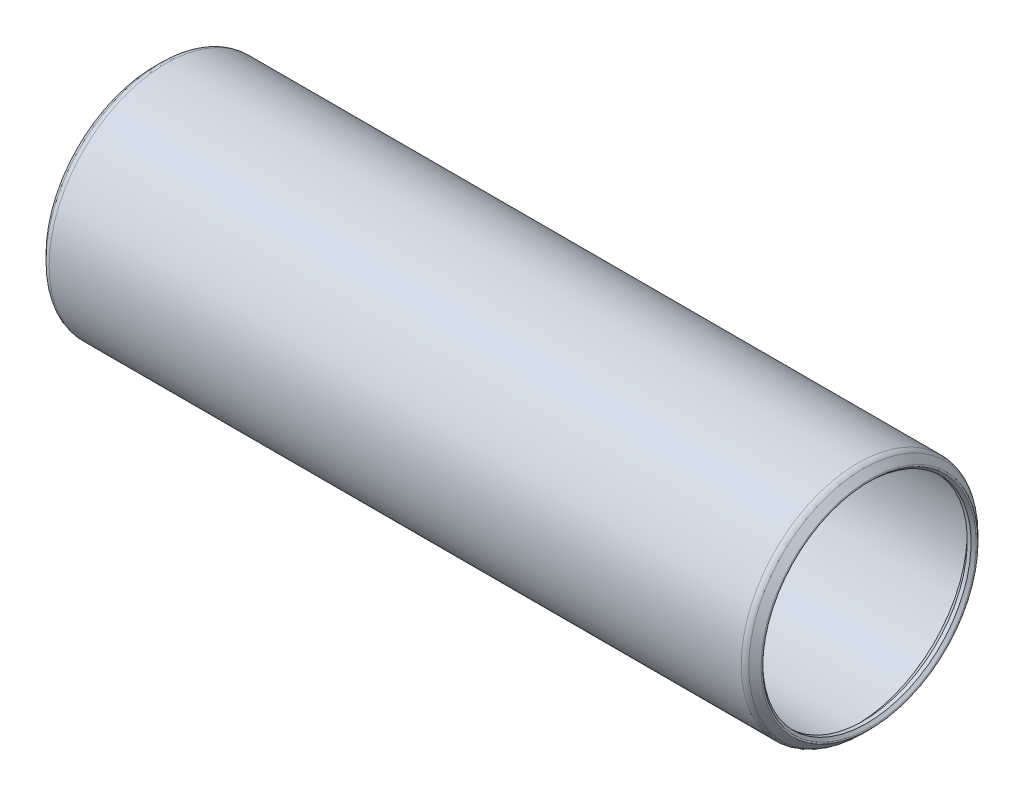
ISO-10303-21;
HEADER;
FILE_DESCRIPTION(('STEP AP214'),'2;1');
FILE_NAME('part.step','',(''),(''),'','','');
FILE_SCHEMA(('AUTOMOTIVE_DESIGN { 1 0 10303 214 1 1 1 1 }'));
ENDSEC;
DATA;
#1=APPLICATION_CONTEXT('core data for automotive mechanical design processes');
#2=APPLICATION_PROTOCOL_DEFINITION('international standard','automotive_design',2000,#1);
#3=PRODUCT_CONTEXT('',#1,'mechanical');
#4=PRODUCT('Part','Part','',(#3));
#5=PRODUCT_RELATED_PRODUCT_CATEGORY('part','',(#4));
#6=PRODUCT_DEFINITION_FORMATION('','',#4);
#7=PRODUCT_DEFINITION_CONTEXT('part definition',#1,'design');
#8=PRODUCT_DEFINITION('design','',#6,#7);
#9=PRODUCT_DEFINITION_SHAPE('','',#8);
#10=(LENGTH_UNIT() NAMED_UNIT(*) SI_UNIT(.MILLI.,.METRE.));
#11=(NAMED_UNIT(*) PLANE_ANGLE_UNIT() SI_UNIT($,.RADIAN.));
#12=(NAMED_UNIT(*) SI_UNIT($,.STERADIAN.) SOLID_ANGLE_UNIT());
#13=UNCERTAINTY_MEASURE_WITH_UNIT(LENGTH_MEASURE(1.E-05),#10,'distance_accuracy_value','');
#14=(GEOMETRIC_REPRESENTATION_CONTEXT(3) GLOBAL_UNCERTAINTY_ASSIGNED_CONTEXT((#13)) GLOBAL_UNIT_ASSIGNED_CONTEXT((#10,
#11,#12)) REPRESENTATION_CONTEXT('',''));
#15=CARTESIAN_POINT('',(0.,0.,0.));
#16=DIRECTION('',(0.,0.,1.));
#17=DIRECTION('',(1.,0.,0.));
#18=AXIS2_PLACEMENT_3D('',#15,#16,#17);
#19=CARTESIAN_POINT('',(-0.549710244842029,0.,0.));
#20=DIRECTION('',(-1.,0.,0.));
#21=DIRECTION('',(0.,0.,1.));
#22=AXIS2_PLACEMENT_3D('',#19,#20,#21);
#23=TOROIDAL_SURFACE('',#22,10.832165367264,0.127000000000741);
#24=CARTESIAN_POINT('',(-0.639512806053455,0.,0.));
#25=DIRECTION('',(-1.,0.,0.));
#26=DIRECTION('',(0.,0.,1.));
#27=AXIS2_PLACEMENT_3D('',#24,#25,#26);
#28=CIRCLE('',#27,10.742362806053);
#29=CARTESIAN_POINT('',(-0.639512806053455,0.,10.742362806053));
#30=VERTEX_POINT('',#29);
#31=EDGE_CURVE('E10',#30,#30,#28,.T.);
#32=ORIENTED_EDGE('',*,*,#31,.F.);
#33=EDGE_LOOP('',(#32));
#34=FACE_BOUND('',#33,.T.);
#35=CARTESIAN_POINT('',(-0.639512806053455,0.,0.));
#36=DIRECTION('',(-1.,0.,0.));
#37=DIRECTION('',(0.,0.,1.));
#38=AXIS2_PLACEMENT_3D('',#35,#36,#37);
#39=CIRCLE('',#38,10.921967928475);
#40=CARTESIAN_POINT('',(-0.639512806053455,0.,10.921967928475));
#41=VERTEX_POINT('',#40);
#42=EDGE_CURVE('E80',#41,#41,#39,.T.);
#43=ORIENTED_EDGE('',*,*,#42,.T.);
#44=EDGE_LOOP('',(#43));
#45=FACE_BOUND('',#44,.T.);
#46=ADVANCED_FACE('F34',(#34,#45),#23,.T.);
#47=CARTESIAN_POINT('',(-0.639512806053455,0.,0.));
#48=DIRECTION('',(-1.,0.,0.));
#49=DIRECTION('',(0.,0.,1.));
#50=AXIS2_PLACEMENT_3D('',#47,#48,#49);
#51=CONICAL_SURFACE('',#50,10.742362806053,0.785398163396579);
#52=CARTESIAN_POINT('',(-0.381000000000006,0.,0.));
#53=DIRECTION('',(-1.,0.,0.));
#54=DIRECTION('',(0.,0.,1.));
#55=AXIS2_PLACEMENT_3D('',#52,#53,#54);
#56=CIRCLE('',#55,10.48385);
#57=CARTESIAN_POINT('',(-0.381000000000006,0.,10.48385));
#58=VERTEX_POINT('',#57);
#59=EDGE_CURVE('E40',#58,#58,#56,.T.);
#60=ORIENTED_EDGE('',*,*,#59,.F.);
#61=EDGE_LOOP('',(#60));
#62=FACE_BOUND('',#61,.T.);
#63=ORIENTED_EDGE('',*,*,#31,.T.);
#64=EDGE_LOOP('',(#63));
#65=FACE_BOUND('',#64,.T.);
#66=ADVANCED_FACE('F153',(#62,#65),#51,.F.);
#67=CARTESIAN_POINT('',(70.7009,0.,0.));
#68=DIRECTION('',(-1.,0.,0.));
#69=DIRECTION('',(0.,0.,1.));
#70=AXIS2_PLACEMENT_3D('',#67,#68,#69);
#71=CYLINDRICAL_SURFACE('',#70,10.48385);
#72=CARTESIAN_POINT('',(0.,0.,0.));
#73=DIRECTION('',(-1.,0.,0.));
#74=DIRECTION('',(0.,0.,1.));
#75=AXIS2_PLACEMENT_3D('',#72,#73,#74);
#76=CIRCLE('',#75,10.48385);
#77=CARTESIAN_POINT('',(0.,0.,10.48385));
#78=VERTEX_POINT('',#77);
#79=EDGE_CURVE('E44',#78,#78,#76,.T.);
#80=ORIENTED_EDGE('',*,*,#79,.F.);
#81=EDGE_LOOP('',(#80));
#82=FACE_BOUND('',#81,.T.);
#83=ORIENTED_EDGE('',*,*,#59,.T.);
#84=EDGE_LOOP('',(#83));
#85=FACE_BOUND('',#84,.T.);
#86=ADVANCED_FACE('F148',(#82,#85),#71,.F.);
#87=CARTESIAN_POINT('',(0.,0.,0.));
#88=DIRECTION('',(1.,0.,0.));
#89=DIRECTION('',(0.,0.,-1.));
#90=AXIS2_PLACEMENT_3D('',#87,#88,#89);
#91=CONICAL_SURFACE('',#90,10.48385,0.78539816339745);
#92=CARTESIAN_POINT('',(0.761999999999999,0.,0.));
#93=DIRECTION('',(-1.,0.,0.));
#94=DIRECTION('',(0.,0.,1.));
#95=AXIS2_PLACEMENT_3D('',#92,#93,#94);
#96=CIRCLE('',#95,11.24585);
#97=CARTESIAN_POINT('',(0.761999999999999,0.,11.24585));
#98=VERTEX_POINT('',#97);
#99=EDGE_CURVE('E48',#98,#98,#96,.T.);
#100=ORIENTED_EDGE('',*,*,#99,.F.);
#101=EDGE_LOOP('',(#100));
#102=FACE_BOUND('',#101,.T.);
#103=ORIENTED_EDGE('',*,*,#79,.T.);
#104=EDGE_LOOP('',(#103));
#105=FACE_BOUND('',#104,.T.);
#106=ADVANCED_FACE('F142',(#102,#105),#91,.F.);
#107=CARTESIAN_POINT('',(70.7009,0.,0.));
#108=DIRECTION('',(-1.,0.,0.));
#109=DIRECTION('',(0.,0.,1.));
#110=AXIS2_PLACEMENT_3D('',#107,#108,#109);
#111=CYLINDRICAL_SURFACE('',#110,11.24585);
#112=CARTESIAN_POINT('',(69.9389,0.,0.));
#113=DIRECTION('',(-1.,0.,0.));
#114=DIRECTION('',(0.,0.,1.));
#115=AXIS2_PLACEMENT_3D('',#112,#113,#114);
#116=CIRCLE('',#115,11.24585);
#117=CARTESIAN_POINT('',(69.9389,0.,11.24585));
#118=VERTEX_POINT('',#117);
#119=EDGE_CURVE('E53',#118,#118,#116,.T.);
#120=ORIENTED_EDGE('',*,*,#119,.F.);
#121=EDGE_LOOP('',(#120));
#122=FACE_BOUND('',#121,.T.);
#123=ORIENTED_EDGE('',*,*,#99,.T.);
#124=EDGE_LOOP('',(#123));
#125=FACE_BOUND('',#124,.T.);
#126=ADVANCED_FACE('F136',(#122,#125),#111,.F.);
#127=CARTESIAN_POINT('',(69.9389,0.,0.));
#128=DIRECTION('',(-1.,0.,0.));
#129=DIRECTION('',(0.,0.,1.));
#130=AXIS2_PLACEMENT_3D('',#127,#128,#129);
#131=CONICAL_SURFACE('',#130,11.24585,0.78539816339745);
#132=CARTESIAN_POINT('',(70.7009,0.,0.));
#133=DIRECTION('',(-1.,0.,0.));
#134=DIRECTION('',(0.,0.,1.));
#135=AXIS2_PLACEMENT_3D('',#132,#133,#134);
#136=CIRCLE('',#135,10.48385);
#137=CARTESIAN_POINT('',(70.7009,0.,10.48385));
#138=VERTEX_POINT('',#137);
#139=EDGE_CURVE('E56',#138,#138,#136,.T.);
#140=ORIENTED_EDGE('',*,*,#139,.F.);
#141=EDGE_LOOP('',(#140));
#142=FACE_BOUND('',#141,.T.);
#143=ORIENTED_EDGE('',*,*,#119,.T.);
#144=EDGE_LOOP('',(#143));
#145=FACE_BOUND('',#144,.T.);
#146=ADVANCED_FACE('F130',(#142,#145),#131,.F.);
#147=CARTESIAN_POINT('',(70.7009,0.,0.));
#148=DIRECTION('',(-1.,0.,0.));
#149=DIRECTION('',(0.,0.,1.));
#150=AXIS2_PLACEMENT_3D('',#147,#148,#149);
#151=CYLINDRICAL_SURFACE('',#150,10.48385);
#152=CARTESIAN_POINT('',(71.0819,0.,0.));
#153=DIRECTION('',(-1.,0.,0.));
#154=DIRECTION('',(0.,0.,1.));
#155=AXIS2_PLACEMENT_3D('',#152,#153,#154);
#156=CIRCLE('',#155,10.48385);
#157=CARTESIAN_POINT('',(71.0819,0.,10.48385));
#158=VERTEX_POINT('',#157);
#159=EDGE_CURVE('E59',#158,#158,#156,.T.);
#160=ORIENTED_EDGE('',*,*,#159,.F.);
#161=EDGE_LOOP('',(#160));
#162=FACE_BOUND('',#161,.T.);
#163=ORIENTED_EDGE('',*,*,#139,.T.);
#164=EDGE_LOOP('',(#163));
#165=FACE_BOUND('',#164,.T.);
#166=ADVANCED_FACE('F124',(#162,#165),#151,.F.);
#167=CARTESIAN_POINT('',(71.0819,0.,0.));
#168=DIRECTION('',(1.,0.,0.));
#169=DIRECTION('',(0.,0.,-1.));
#170=AXIS2_PLACEMENT_3D('',#167,#168,#169);
#171=CONICAL_SURFACE('',#170,10.48385,0.785398163397257);
#172=CARTESIAN_POINT('',(71.3404128060541,0.,0.));
#173=DIRECTION('',(-1.,0.,0.));
#174=DIRECTION('',(0.,0.,1.));
#175=AXIS2_PLACEMENT_3D('',#172,#173,#174);
#176=CIRCLE('',#175,10.742362806054);
#177=CARTESIAN_POINT('',(71.3404128060541,0.,10.742362806054));
#178=VERTEX_POINT('',#177);
#179=EDGE_CURVE('E62',#178,#178,#176,.T.);
#180=ORIENTED_EDGE('',*,*,#179,.F.);
#181=EDGE_LOOP('',(#180));
#182=FACE_BOUND('',#181,.T.);
#183=ORIENTED_EDGE('',*,*,#159,.T.);
#184=EDGE_LOOP('',(#183));
#185=FACE_BOUND('',#184,.T.);
#186=ADVANCED_FACE('F118',(#182,#185),#171,.F.);
#187=CARTESIAN_POINT('',(71.2506102448439,0.,0.));
#188=DIRECTION('',(-1.,0.,0.));
#189=DIRECTION('',(0.,0.,1.));
#190=AXIS2_PLACEMENT_3D('',#187,#188,#189);
#191=TOROIDAL_SURFACE('',#190,10.832165367264,0.126999999999133);
#192=CARTESIAN_POINT('',(71.3404128060541,0.,0.));
#193=DIRECTION('',(-1.,0.,0.));
#194=DIRECTION('',(0.,0.,1.));
#195=AXIS2_PLACEMENT_3D('',#192,#193,#194);
#196=CIRCLE('',#195,10.9219679284741);
#197=CARTESIAN_POINT('',(71.3404128060541,0.,10.9219679284741));
#198=VERTEX_POINT('',#197);
#199=EDGE_CURVE('E65',#198,#198,#196,.T.);
#200=ORIENTED_EDGE('',*,*,#199,.F.);
#201=EDGE_LOOP('',(#200));
#202=FACE_BOUND('',#201,.T.);
#203=ORIENTED_EDGE('',*,*,#179,.T.);
#204=EDGE_LOOP('',(#203));
#205=FACE_BOUND('',#204,.T.);
#206=ADVANCED_FACE('F112',(#202,#205),#191,.T.);
#207=CARTESIAN_POINT('',(71.3404128060541,0.,0.));
#208=DIRECTION('',(-1.,0.,0.));
#209=DIRECTION('',(0.,0.,1.));
#210=AXIS2_PLACEMENT_3D('',#207,#208,#209);
#211=CONICAL_SURFACE('',#210,10.9219679284741,0.785398163397464);
#212=CARTESIAN_POINT('',(70.7253653672625,0.,0.));
#213=DIRECTION('',(-1.,0.,0.));
#214=DIRECTION('',(0.,0.,1.));
#215=AXIS2_PLACEMENT_3D('',#212,#213,#214);
#216=CIRCLE('',#215,11.5370153672658);
#217=CARTESIAN_POINT('',(70.7253653672625,0.,11.5370153672658));
#218=VERTEX_POINT('',#217);
#219=EDGE_CURVE('E68',#218,#218,#216,.T.);
#220=ORIENTED_EDGE('',*,*,#219,.F.);
#221=EDGE_LOOP('',(#220));
#222=FACE_BOUND('',#221,.T.);
#223=ORIENTED_EDGE('',*,*,#199,.T.);
#224=EDGE_LOOP('',(#223));
#225=FACE_BOUND('',#224,.T.);
#226=ADVANCED_FACE('F106',(#222,#225),#211,.T.);
#227=CARTESIAN_POINT('',(70.1865500000017,0.,0.));
#228=DIRECTION('',(-1.,0.,0.));
#229=DIRECTION('',(0.,0.,1.));
#230=AXIS2_PLACEMENT_3D('',#227,#228,#229);
#231=TOROIDAL_SURFACE('',#230,10.9982000000049,0.761999999995272);
#232=CARTESIAN_POINT('',(70.1865500000017,0.,0.));
#233=DIRECTION('',(-1.,0.,0.));
#234=DIRECTION('',(0.,0.,1.));
#235=AXIS2_PLACEMENT_3D('',#232,#233,#234);
#236=CIRCLE('',#235,11.7602000000002);
#237=CARTESIAN_POINT('',(70.1865500000017,0.,11.7602000000002));
#238=VERTEX_POINT('',#237);
#239=EDGE_CURVE('E71',#238,#238,#236,.T.);
#240=ORIENTED_EDGE('',*,*,#239,.F.);
#241=EDGE_LOOP('',(#240));
#242=FACE_BOUND('',#241,.T.);
#243=ORIENTED_EDGE('',*,*,#219,.T.);
#244=EDGE_LOOP('',(#243));
#245=FACE_BOUND('',#244,.T.);
#246=ADVANCED_FACE('F100',(#242,#245),#231,.T.);
#247=CARTESIAN_POINT('',(70.7009,0.,0.));
#248=DIRECTION('',(-1.,0.,0.));
#249=DIRECTION('',(0.,0.,1.));
#250=AXIS2_PLACEMENT_3D('',#247,#248,#249);
#251=CYLINDRICAL_SURFACE('',#250,11.7602000000002);
#252=CARTESIAN_POINT('',(0.514349999997846,0.,0.));
#253=DIRECTION('',(-1.,0.,0.));
#254=DIRECTION('',(0.,0.,1.));
#255=AXIS2_PLACEMENT_3D('',#252,#253,#254);
#256=CIRCLE('',#255,11.7602000000002);
#257=CARTESIAN_POINT('',(0.514349999997846,0.,11.7602000000002));
#258=VERTEX_POINT('',#257);
#259=EDGE_CURVE('E74',#258,#258,#256,.T.);
#260=ORIENTED_EDGE('',*,*,#259,.F.);
#261=EDGE_LOOP('',(#260));
#262=FACE_BOUND('',#261,.T.);
#263=ORIENTED_EDGE('',*,*,#239,.T.);
#264=EDGE_LOOP('',(#263));
#265=FACE_BOUND('',#264,.T.);
#266=ADVANCED_FACE('F94',(#262,#265),#251,.T.);
#267=CARTESIAN_POINT('',(0.514349999998008,0.,0.));
#268=DIRECTION('',(-1.,0.,0.));
#269=DIRECTION('',(0.,0.,1.));
#270=AXIS2_PLACEMENT_3D('',#267,#268,#269);
#271=TOROIDAL_SURFACE('',#270,10.9982000000052,0.76199999999502);
#272=CARTESIAN_POINT('',(-0.0244653672626383,0.,0.));
#273=DIRECTION('',(-1.,0.,0.));
#274=DIRECTION('',(0.,0.,1.));
#275=AXIS2_PLACEMENT_3D('',#272,#273,#274);
#276=CIRCLE('',#275,11.5370153672658);
#277=CARTESIAN_POINT('',(-0.0244653672626383,0.,11.5370153672658));
#278=VERTEX_POINT('',#277);
#279=EDGE_CURVE('E77',#278,#278,#276,.T.);
#280=ORIENTED_EDGE('',*,*,#279,.F.);
#281=EDGE_LOOP('',(#280));
#282=FACE_BOUND('',#281,.T.);
#283=ORIENTED_EDGE('',*,*,#259,.T.);
#284=EDGE_LOOP('',(#283));
#285=FACE_BOUND('',#284,.T.);
#286=ADVANCED_FACE('F88',(#282,#285),#271,.T.);
#287=CARTESIAN_POINT('',(-0.0244653672626383,0.,0.));
#288=DIRECTION('',(1.,0.,0.));
#289=DIRECTION('',(0.,0.,-1.));
#290=AXIS2_PLACEMENT_3D('',#287,#288,#289);
#291=CONICAL_SURFACE('',#290,11.5370153672658,0.785398163397451);
#292=ORIENTED_EDGE('',*,*,#42,.F.);
#293=EDGE_LOOP('',(#292));
#294=FACE_BOUND('',#293,.T.);
#295=ORIENTED_EDGE('',*,*,#279,.T.);
#296=EDGE_LOOP('',(#295));
#297=FACE_BOUND('',#296,.T.);
#298=ADVANCED_FACE('F85',(#294,#297),#291,.T.);
#299=CLOSED_SHELL('',(#46,#66,#86,#106,#126,#146,#166,#186,#206,#226,#246,#266,#286,#298));
#300=MANIFOLD_SOLID_BREP('B2',#299);
#301=ADVANCED_BREP_SHAPE_REPRESENTATION('',(#18,#300),#14);
#302=SHAPE_DEFINITION_REPRESENTATION(#9,#301);
ENDSEC;
END-ISO-10303-21;
